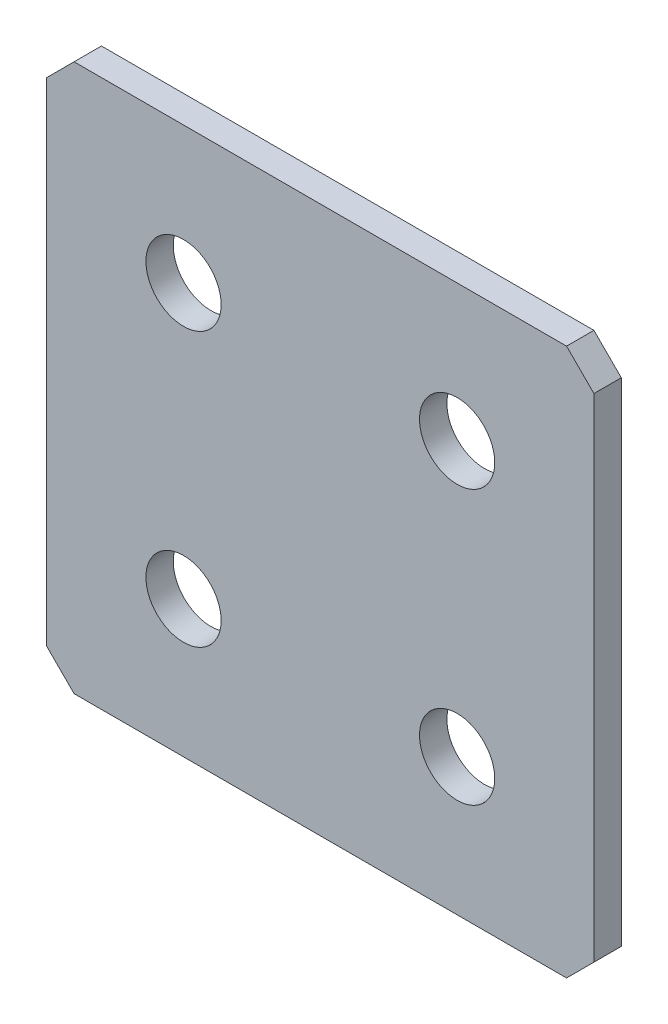
ISO-10303-21;
HEADER;
FILE_DESCRIPTION(('STEP AP214'),'2;1');
FILE_NAME('part.step','',(''),(''),'','','');
FILE_SCHEMA(('AUTOMOTIVE_DESIGN { 1 0 10303 214 1 1 1 1 }'));
ENDSEC;
DATA;
#1=APPLICATION_CONTEXT('core data for automotive mechanical design processes');
#2=APPLICATION_PROTOCOL_DEFINITION('international standard','automotive_design',2000,#1);
#3=PRODUCT_CONTEXT('',#1,'mechanical');
#4=PRODUCT('Part','Part','',(#3));
#5=PRODUCT_RELATED_PRODUCT_CATEGORY('part','',(#4));
#6=PRODUCT_DEFINITION_FORMATION('','',#4);
#7=PRODUCT_DEFINITION_CONTEXT('part definition',#1,'design');
#8=PRODUCT_DEFINITION('design','',#6,#7);
#9=PRODUCT_DEFINITION_SHAPE('','',#8);
#10=(LENGTH_UNIT() NAMED_UNIT(*) SI_UNIT(.MILLI.,.METRE.));
#11=(NAMED_UNIT(*) PLANE_ANGLE_UNIT() SI_UNIT($,.RADIAN.));
#12=(NAMED_UNIT(*) SI_UNIT($,.STERADIAN.) SOLID_ANGLE_UNIT());
#13=UNCERTAINTY_MEASURE_WITH_UNIT(LENGTH_MEASURE(1.E-05),#10,'distance_accuracy_value','');
#14=(GEOMETRIC_REPRESENTATION_CONTEXT(3) GLOBAL_UNCERTAINTY_ASSIGNED_CONTEXT((#13)) GLOBAL_UNIT_ASSIGNED_CONTEXT((#10,
#11,#12)) REPRESENTATION_CONTEXT('',''));
#15=CARTESIAN_POINT('',(0.,0.,0.));
#16=DIRECTION('',(0.,0.,1.));
#17=DIRECTION('',(1.,0.,0.));
#18=AXIS2_PLACEMENT_3D('',#15,#16,#17);
#19=CARTESIAN_POINT('',(20.,-20.,2.));
#20=DIRECTION('',(-1.,0.,0.));
#21=DIRECTION('',(0.,0.,1.));
#22=AXIS2_PLACEMENT_3D('',#19,#20,#21);
#23=PLANE('',#22);
#24=DIRECTION('',(0.,1.,0.));
#25=VECTOR('',#24,1.);
#26=CARTESIAN_POINT('',(20.,-20.,2.));
#27=LINE('',#26,#25);
#28=CARTESIAN_POINT('',(20.,-18.,2.));
#29=VERTEX_POINT('',#28);
#30=CARTESIAN_POINT('',(20.,18.,2.));
#31=VERTEX_POINT('',#30);
#32=EDGE_CURVE('E135',#29,#31,#27,.T.);
#33=ORIENTED_EDGE('',*,*,#32,.F.);
#34=DIRECTION('',(0.,0.,-1.));
#35=VECTOR('',#34,1.);
#36=CARTESIAN_POINT('',(20.,-18.,2.));
#37=LINE('',#36,#35);
#38=CARTESIAN_POINT('',(20.,-18.,0.));
#39=VERTEX_POINT('',#38);
#40=EDGE_CURVE('E174',#29,#39,#37,.T.);
#41=ORIENTED_EDGE('',*,*,#40,.T.);
#42=DIRECTION('',(0.,1.,0.));
#43=VECTOR('',#42,1.);
#44=CARTESIAN_POINT('',(20.,-20.,0.));
#45=LINE('',#44,#43);
#46=CARTESIAN_POINT('',(20.,18.,0.));
#47=VERTEX_POINT('',#46);
#48=EDGE_CURVE('E185',#39,#47,#45,.T.);
#49=ORIENTED_EDGE('',*,*,#48,.T.);
#50=DIRECTION('',(0.,0.,1.));
#51=VECTOR('',#50,1.);
#52=CARTESIAN_POINT('',(20.,18.,2.));
#53=LINE('',#52,#51);
#54=EDGE_CURVE('E171',#47,#31,#53,.T.);
#55=ORIENTED_EDGE('',*,*,#54,.T.);
#56=EDGE_LOOP('',(#33,#41,#49,#55));
#57=FACE_BOUND('',#56,.T.);
#58=ADVANCED_FACE('F40',(#57),#23,.F.);
#59=CARTESIAN_POINT('',(-20.,20.,2.));
#60=DIRECTION('',(0.,-1.,0.));
#61=DIRECTION('',(0.,0.,-1.));
#62=AXIS2_PLACEMENT_3D('',#59,#60,#61);
#63=PLANE('',#62);
#64=DIRECTION('',(-1.,0.,0.));
#65=VECTOR('',#64,1.);
#66=CARTESIAN_POINT('',(-20.,20.,0.));
#67=LINE('',#66,#65);
#68=CARTESIAN_POINT('',(18.,20.,0.));
#69=VERTEX_POINT('',#68);
#70=CARTESIAN_POINT('',(-18.,20.,0.));
#71=VERTEX_POINT('',#70);
#72=EDGE_CURVE('E143',#69,#71,#67,.T.);
#73=ORIENTED_EDGE('',*,*,#72,.T.);
#74=DIRECTION('',(0.,0.,1.));
#75=VECTOR('',#74,1.);
#76=CARTESIAN_POINT('',(-18.,20.,2.));
#77=LINE('',#76,#75);
#78=CARTESIAN_POINT('',(-18.,20.,2.));
#79=VERTEX_POINT('',#78);
#80=EDGE_CURVE('E11',#71,#79,#77,.T.);
#81=ORIENTED_EDGE('',*,*,#80,.T.);
#82=DIRECTION('',(-1.,0.,0.));
#83=VECTOR('',#82,1.);
#84=CARTESIAN_POINT('',(-20.,20.,2.));
#85=LINE('',#84,#83);
#86=CARTESIAN_POINT('',(18.,20.,2.));
#87=VERTEX_POINT('',#86);
#88=EDGE_CURVE('E140',#87,#79,#85,.T.);
#89=ORIENTED_EDGE('',*,*,#88,.F.);
#90=DIRECTION('',(0.,0.,-1.));
#91=VECTOR('',#90,1.);
#92=CARTESIAN_POINT('',(18.,20.,2.));
#93=LINE('',#92,#91);
#94=EDGE_CURVE('E49',#87,#69,#93,.T.);
#95=ORIENTED_EDGE('',*,*,#94,.T.);
#96=EDGE_LOOP('',(#73,#81,#89,#95));
#97=FACE_BOUND('',#96,.T.);
#98=ADVANCED_FACE('F181',(#97),#63,.F.);
#99=CARTESIAN_POINT('',(-20.,-20.,2.));
#100=DIRECTION('',(1.,0.,0.));
#101=DIRECTION('',(0.,0.,-1.));
#102=AXIS2_PLACEMENT_3D('',#99,#100,#101);
#103=PLANE('',#102);
#104=DIRECTION('',(0.,-1.,0.));
#105=VECTOR('',#104,1.);
#106=CARTESIAN_POINT('',(-20.,-20.,0.));
#107=LINE('',#106,#105);
#108=CARTESIAN_POINT('',(-20.,18.,0.));
#109=VERTEX_POINT('',#108);
#110=CARTESIAN_POINT('',(-20.,-18.,0.));
#111=VERTEX_POINT('',#110);
#112=EDGE_CURVE('E136',#109,#111,#107,.T.);
#113=ORIENTED_EDGE('',*,*,#112,.T.);
#114=DIRECTION('',(0.,0.,1.));
#115=VECTOR('',#114,1.);
#116=CARTESIAN_POINT('',(-20.,-18.,2.));
#117=LINE('',#116,#115);
#118=CARTESIAN_POINT('',(-20.,-18.,2.));
#119=VERTEX_POINT('',#118);
#120=EDGE_CURVE('E111',#111,#119,#117,.T.);
#121=ORIENTED_EDGE('',*,*,#120,.T.);
#122=DIRECTION('',(0.,-1.,0.));
#123=VECTOR('',#122,1.);
#124=CARTESIAN_POINT('',(-20.,-20.,2.));
#125=LINE('',#124,#123);
#126=CARTESIAN_POINT('',(-20.,18.,2.));
#127=VERTEX_POINT('',#126);
#128=EDGE_CURVE('E193',#127,#119,#125,.T.);
#129=ORIENTED_EDGE('',*,*,#128,.F.);
#130=DIRECTION('',(0.,0.,-1.));
#131=VECTOR('',#130,1.);
#132=CARTESIAN_POINT('',(-20.,18.,2.));
#133=LINE('',#132,#131);
#134=EDGE_CURVE('E117',#127,#109,#133,.T.);
#135=ORIENTED_EDGE('',*,*,#134,.T.);
#136=EDGE_LOOP('',(#113,#121,#129,#135));
#137=FACE_BOUND('',#136,.T.);
#138=ADVANCED_FACE('F245',(#137),#103,.F.);
#139=CARTESIAN_POINT('',(-20.,-20.,2.));
#140=DIRECTION('',(0.,1.,0.));
#141=DIRECTION('',(0.,0.,1.));
#142=AXIS2_PLACEMENT_3D('',#139,#140,#141);
#143=PLANE('',#142);
#144=DIRECTION('',(1.,0.,0.));
#145=VECTOR('',#144,1.);
#146=CARTESIAN_POINT('',(-20.,-20.,2.));
#147=LINE('',#146,#145);
#148=CARTESIAN_POINT('',(-18.,-20.,2.));
#149=VERTEX_POINT('',#148);
#150=CARTESIAN_POINT('',(18.,-20.,2.));
#151=VERTEX_POINT('',#150);
#152=EDGE_CURVE('E127',#149,#151,#147,.T.);
#153=ORIENTED_EDGE('',*,*,#152,.F.);
#154=DIRECTION('',(0.,0.,-1.));
#155=VECTOR('',#154,1.);
#156=CARTESIAN_POINT('',(-18.,-20.,2.));
#157=LINE('',#156,#155);
#158=CARTESIAN_POINT('',(-18.,-20.,0.));
#159=VERTEX_POINT('',#158);
#160=EDGE_CURVE('E110',#149,#159,#157,.T.);
#161=ORIENTED_EDGE('',*,*,#160,.T.);
#162=DIRECTION('',(1.,0.,0.));
#163=VECTOR('',#162,1.);
#164=CARTESIAN_POINT('',(-20.,-20.,0.));
#165=LINE('',#164,#163);
#166=CARTESIAN_POINT('',(18.,-20.,0.));
#167=VERTEX_POINT('',#166);
#168=EDGE_CURVE('E124',#159,#167,#165,.T.);
#169=ORIENTED_EDGE('',*,*,#168,.T.);
#170=DIRECTION('',(0.,0.,1.));
#171=VECTOR('',#170,1.);
#172=CARTESIAN_POINT('',(18.,-20.,2.));
#173=LINE('',#172,#171);
#174=EDGE_CURVE('E130',#167,#151,#173,.T.);
#175=ORIENTED_EDGE('',*,*,#174,.T.);
#176=EDGE_LOOP('',(#153,#161,#169,#175));
#177=FACE_BOUND('',#176,.T.);
#178=ADVANCED_FACE('F123',(#177),#143,.F.);
#179=CARTESIAN_POINT('',(0.,0.,2.));
#180=DIRECTION('',(0.,0.,-1.));
#181=DIRECTION('',(-1.,0.,0.));
#182=AXIS2_PLACEMENT_3D('',#179,#180,#181);
#183=PLANE('',#182);
#184=CARTESIAN_POINT('',(-10.,10.,2.));
#185=DIRECTION('',(0.,0.,1.));
#186=DIRECTION('',(1.,0.,0.));
#187=AXIS2_PLACEMENT_3D('',#184,#185,#186);
#188=CIRCLE('',#187,2.75);
#189=CARTESIAN_POINT('',(-7.25,10.,2.));
#190=VERTEX_POINT('',#189);
#191=EDGE_CURVE('E225',#190,#190,#188,.T.);
#192=ORIENTED_EDGE('',*,*,#191,.F.);
#193=EDGE_LOOP('',(#192));
#194=FACE_BOUND('',#193,.T.);
#195=CARTESIAN_POINT('',(10.,10.,2.));
#196=DIRECTION('',(0.,0.,1.));
#197=DIRECTION('',(1.,0.,0.));
#198=AXIS2_PLACEMENT_3D('',#195,#196,#197);
#199=CIRCLE('',#198,2.75);
#200=CARTESIAN_POINT('',(12.75,10.,2.));
#201=VERTEX_POINT('',#200);
#202=EDGE_CURVE('E217',#201,#201,#199,.T.);
#203=ORIENTED_EDGE('',*,*,#202,.F.);
#204=EDGE_LOOP('',(#203));
#205=FACE_BOUND('',#204,.T.);
#206=CARTESIAN_POINT('',(-10.,-10.,2.));
#207=DIRECTION('',(0.,0.,1.));
#208=DIRECTION('',(1.,0.,0.));
#209=AXIS2_PLACEMENT_3D('',#206,#207,#208);
#210=CIRCLE('',#209,2.75);
#211=CARTESIAN_POINT('',(-7.25,-10.,2.));
#212=VERTEX_POINT('',#211);
#213=EDGE_CURVE('E210',#212,#212,#210,.T.);
#214=ORIENTED_EDGE('',*,*,#213,.F.);
#215=EDGE_LOOP('',(#214));
#216=FACE_BOUND('',#215,.T.);
#217=CARTESIAN_POINT('',(9.99999999999999,-10.,2.));
#218=DIRECTION('',(0.,0.,1.));
#219=DIRECTION('',(1.,0.,0.));
#220=AXIS2_PLACEMENT_3D('',#217,#218,#219);
#221=CIRCLE('',#220,2.75);
#222=CARTESIAN_POINT('',(12.75,-10.,2.));
#223=VERTEX_POINT('',#222);
#224=EDGE_CURVE('E202',#223,#223,#221,.T.);
#225=ORIENTED_EDGE('',*,*,#224,.F.);
#226=EDGE_LOOP('',(#225));
#227=FACE_BOUND('',#226,.T.);
#228=ORIENTED_EDGE('',*,*,#128,.T.);
#229=DIRECTION('',(-0.707106781186546,0.707106781186549,0.));
#230=VECTOR('',#229,1.);
#231=CARTESIAN_POINT('',(-18.,-20.,2.));
#232=LINE('',#231,#230);
#233=EDGE_CURVE('E168',#119,#149,#232,.F.);
#234=ORIENTED_EDGE('',*,*,#233,.T.);
#235=ORIENTED_EDGE('',*,*,#152,.T.);
#236=DIRECTION('',(-0.707106781186549,-0.707106781186546,0.));
#237=VECTOR('',#236,1.);
#238=CARTESIAN_POINT('',(20.,-18.,2.));
#239=LINE('',#238,#237);
#240=EDGE_CURVE('E166',#151,#29,#239,.F.);
#241=ORIENTED_EDGE('',*,*,#240,.T.);
#242=ORIENTED_EDGE('',*,*,#32,.T.);
#243=DIRECTION('',(0.707106781186546,-0.707106781186549,0.));
#244=VECTOR('',#243,1.);
#245=CARTESIAN_POINT('',(18.,20.,2.));
#246=LINE('',#245,#244);
#247=EDGE_CURVE('E61',#31,#87,#246,.F.);
#248=ORIENTED_EDGE('',*,*,#247,.T.);
#249=ORIENTED_EDGE('',*,*,#88,.T.);
#250=DIRECTION('',(0.707106781186549,0.707106781186546,0.));
#251=VECTOR('',#250,1.);
#252=CARTESIAN_POINT('',(-20.,18.,2.));
#253=LINE('',#252,#251);
#254=EDGE_CURVE('E163',#79,#127,#253,.F.);
#255=ORIENTED_EDGE('',*,*,#254,.T.);
#256=EDGE_LOOP('',(#228,#234,#235,#241,#242,#248,#249,#255));
#257=FACE_BOUND('',#256,.T.);
#258=ADVANCED_FACE('F232',(#194,#205,#216,#227,#257),#183,.F.);
#259=CARTESIAN_POINT('',(0.,0.,0.));
#260=DIRECTION('',(0.,0.,-1.));
#261=DIRECTION('',(-1.,0.,0.));
#262=AXIS2_PLACEMENT_3D('',#259,#260,#261);
#263=PLANE('',#262);
#264=CARTESIAN_POINT('',(-10.,10.,0.));
#265=DIRECTION('',(0.,0.,1.));
#266=DIRECTION('',(1.,0.,0.));
#267=AXIS2_PLACEMENT_3D('',#264,#265,#266);
#268=CIRCLE('',#267,2.75);
#269=CARTESIAN_POINT('',(-7.25,10.,0.));
#270=VERTEX_POINT('',#269);
#271=EDGE_CURVE('E221',#270,#270,#268,.T.);
#272=ORIENTED_EDGE('',*,*,#271,.T.);
#273=EDGE_LOOP('',(#272));
#274=FACE_BOUND('',#273,.T.);
#275=CARTESIAN_POINT('',(10.,10.,0.));
#276=DIRECTION('',(0.,0.,1.));
#277=DIRECTION('',(1.,0.,0.));
#278=AXIS2_PLACEMENT_3D('',#275,#276,#277);
#279=CIRCLE('',#278,2.75);
#280=CARTESIAN_POINT('',(12.75,10.,0.));
#281=VERTEX_POINT('',#280);
#282=EDGE_CURVE('E213',#281,#281,#279,.T.);
#283=ORIENTED_EDGE('',*,*,#282,.T.);
#284=EDGE_LOOP('',(#283));
#285=FACE_BOUND('',#284,.T.);
#286=CARTESIAN_POINT('',(-10.,-10.,0.));
#287=DIRECTION('',(0.,0.,1.));
#288=DIRECTION('',(1.,0.,0.));
#289=AXIS2_PLACEMENT_3D('',#286,#287,#288);
#290=CIRCLE('',#289,2.75);
#291=CARTESIAN_POINT('',(-7.25,-10.,0.));
#292=VERTEX_POINT('',#291);
#293=EDGE_CURVE('E206',#292,#292,#290,.T.);
#294=ORIENTED_EDGE('',*,*,#293,.T.);
#295=EDGE_LOOP('',(#294));
#296=FACE_BOUND('',#295,.T.);
#297=CARTESIAN_POINT('',(9.99999999999999,-10.,0.));
#298=DIRECTION('',(0.,0.,1.));
#299=DIRECTION('',(1.,0.,0.));
#300=AXIS2_PLACEMENT_3D('',#297,#298,#299);
#301=CIRCLE('',#300,2.75);
#302=CARTESIAN_POINT('',(12.75,-10.,0.));
#303=VERTEX_POINT('',#302);
#304=EDGE_CURVE('E188',#303,#303,#301,.T.);
#305=ORIENTED_EDGE('',*,*,#304,.T.);
#306=EDGE_LOOP('',(#305));
#307=FACE_BOUND('',#306,.T.);
#308=ORIENTED_EDGE('',*,*,#168,.F.);
#309=DIRECTION('',(0.707106781186546,-0.707106781186549,0.));
#310=VECTOR('',#309,1.);
#311=CARTESIAN_POINT('',(-19.,-19.,0.));
#312=LINE('',#311,#310);
#313=EDGE_CURVE('E106',#159,#111,#312,.F.);
#314=ORIENTED_EDGE('',*,*,#313,.T.);
#315=ORIENTED_EDGE('',*,*,#112,.F.);
#316=DIRECTION('',(-0.707106781186549,-0.707106781186546,0.));
#317=VECTOR('',#316,1.);
#318=CARTESIAN_POINT('',(-19.,19.,0.));
#319=LINE('',#318,#317);
#320=EDGE_CURVE('E151',#109,#71,#319,.F.);
#321=ORIENTED_EDGE('',*,*,#320,.T.);
#322=ORIENTED_EDGE('',*,*,#72,.F.);
#323=DIRECTION('',(-0.707106781186546,0.707106781186549,0.));
#324=VECTOR('',#323,1.);
#325=CARTESIAN_POINT('',(19.,19.,0.));
#326=LINE('',#325,#324);
#327=EDGE_CURVE('E129',#69,#47,#326,.F.);
#328=ORIENTED_EDGE('',*,*,#327,.T.);
#329=ORIENTED_EDGE('',*,*,#48,.F.);
#330=DIRECTION('',(0.707106781186549,0.707106781186546,0.));
#331=VECTOR('',#330,1.);
#332=CARTESIAN_POINT('',(19.,-19.,0.));
#333=LINE('',#332,#331);
#334=EDGE_CURVE('E118',#39,#167,#333,.F.);
#335=ORIENTED_EDGE('',*,*,#334,.T.);
#336=EDGE_LOOP('',(#308,#314,#315,#321,#322,#328,#329,#335));
#337=FACE_BOUND('',#336,.T.);
#338=ADVANCED_FACE('F132',(#274,#285,#296,#307,#337),#263,.T.);
#339=CARTESIAN_POINT('',(-18.,-20.,2.));
#340=DIRECTION('',(0.707106781186549,0.707106781186546,0.));
#341=DIRECTION('',(0.,0.,-1.));
#342=AXIS2_PLACEMENT_3D('',#339,#340,#341);
#343=PLANE('',#342);
#344=ORIENTED_EDGE('',*,*,#233,.F.);
#345=ORIENTED_EDGE('',*,*,#120,.F.);
#346=ORIENTED_EDGE('',*,*,#313,.F.);
#347=ORIENTED_EDGE('',*,*,#160,.F.);
#348=EDGE_LOOP('',(#344,#345,#346,#347));
#349=FACE_BOUND('',#348,.T.);
#350=ADVANCED_FACE('F109',(#349),#343,.F.);
#351=CARTESIAN_POINT('',(20.,-18.,2.));
#352=DIRECTION('',(-0.707106781186546,0.707106781186549,0.));
#353=DIRECTION('',(0.,0.,-1.));
#354=AXIS2_PLACEMENT_3D('',#351,#352,#353);
#355=PLANE('',#354);
#356=ORIENTED_EDGE('',*,*,#240,.F.);
#357=ORIENTED_EDGE('',*,*,#174,.F.);
#358=ORIENTED_EDGE('',*,*,#334,.F.);
#359=ORIENTED_EDGE('',*,*,#40,.F.);
#360=EDGE_LOOP('',(#356,#357,#358,#359));
#361=FACE_BOUND('',#360,.T.);
#362=ADVANCED_FACE('F249',(#361),#355,.F.);
#363=CARTESIAN_POINT('',(-20.,18.,2.));
#364=DIRECTION('',(0.707106781186546,-0.707106781186549,0.));
#365=DIRECTION('',(0.,0.,-1.));
#366=AXIS2_PLACEMENT_3D('',#363,#364,#365);
#367=PLANE('',#366);
#368=ORIENTED_EDGE('',*,*,#254,.F.);
#369=ORIENTED_EDGE('',*,*,#80,.F.);
#370=ORIENTED_EDGE('',*,*,#320,.F.);
#371=ORIENTED_EDGE('',*,*,#134,.F.);
#372=EDGE_LOOP('',(#368,#369,#370,#371));
#373=FACE_BOUND('',#372,.T.);
#374=ADVANCED_FACE('F247',(#373),#367,.F.);
#375=CARTESIAN_POINT('',(18.,20.,2.));
#376=DIRECTION('',(-0.707106781186549,-0.707106781186546,0.));
#377=DIRECTION('',(0.,0.,-1.));
#378=AXIS2_PLACEMENT_3D('',#375,#376,#377);
#379=PLANE('',#378);
#380=ORIENTED_EDGE('',*,*,#247,.F.);
#381=ORIENTED_EDGE('',*,*,#54,.F.);
#382=ORIENTED_EDGE('',*,*,#327,.F.);
#383=ORIENTED_EDGE('',*,*,#94,.F.);
#384=EDGE_LOOP('',(#380,#381,#382,#383));
#385=FACE_BOUND('',#384,.T.);
#386=ADVANCED_FACE('F42',(#385),#379,.F.);
#387=CARTESIAN_POINT('',(9.99999999999999,-10.,2.));
#388=DIRECTION('',(0.,0.,1.));
#389=DIRECTION('',(1.,0.,0.));
#390=AXIS2_PLACEMENT_3D('',#387,#388,#389);
#391=CYLINDRICAL_SURFACE('',#390,2.75);
#392=ORIENTED_EDGE('',*,*,#304,.F.);
#393=EDGE_LOOP('',(#392));
#394=FACE_BOUND('',#393,.T.);
#395=ORIENTED_EDGE('',*,*,#224,.T.);
#396=EDGE_LOOP('',(#395));
#397=FACE_BOUND('',#396,.T.);
#398=ADVANCED_FACE('F254',(#394,#397),#391,.F.);
#399=CARTESIAN_POINT('',(-10.,-10.,2.));
#400=DIRECTION('',(0.,0.,1.));
#401=DIRECTION('',(1.,0.,0.));
#402=AXIS2_PLACEMENT_3D('',#399,#400,#401);
#403=CYLINDRICAL_SURFACE('',#402,2.75);
#404=ORIENTED_EDGE('',*,*,#293,.F.);
#405=EDGE_LOOP('',(#404));
#406=FACE_BOUND('',#405,.T.);
#407=ORIENTED_EDGE('',*,*,#213,.T.);
#408=EDGE_LOOP('',(#407));
#409=FACE_BOUND('',#408,.T.);
#410=ADVANCED_FACE('F316',(#406,#409),#403,.F.);
#411=CARTESIAN_POINT('',(10.,10.,2.));
#412=DIRECTION('',(0.,0.,1.));
#413=DIRECTION('',(1.,0.,0.));
#414=AXIS2_PLACEMENT_3D('',#411,#412,#413);
#415=CYLINDRICAL_SURFACE('',#414,2.75);
#416=ORIENTED_EDGE('',*,*,#282,.F.);
#417=EDGE_LOOP('',(#416));
#418=FACE_BOUND('',#417,.T.);
#419=ORIENTED_EDGE('',*,*,#202,.T.);
#420=EDGE_LOOP('',(#419));
#421=FACE_BOUND('',#420,.T.);
#422=ADVANCED_FACE('F324',(#418,#421),#415,.F.);
#423=CARTESIAN_POINT('',(-10.,10.,2.));
#424=DIRECTION('',(0.,0.,1.));
#425=DIRECTION('',(1.,0.,0.));
#426=AXIS2_PLACEMENT_3D('',#423,#424,#425);
#427=CYLINDRICAL_SURFACE('',#426,2.75);
#428=ORIENTED_EDGE('',*,*,#271,.F.);
#429=EDGE_LOOP('',(#428));
#430=FACE_BOUND('',#429,.T.);
#431=ORIENTED_EDGE('',*,*,#191,.T.);
#432=EDGE_LOOP('',(#431));
#433=FACE_BOUND('',#432,.T.);
#434=ADVANCED_FACE('F230',(#430,#433),#427,.F.);
#435=CLOSED_SHELL('',(#58,#98,#138,#178,#258,#338,#350,#362,#374,#386,#398,#410,#422,#434));
#436=MANIFOLD_SOLID_BREP('B2',#435);
#437=ADVANCED_BREP_SHAPE_REPRESENTATION('',(#18,#436),#14);
#438=SHAPE_DEFINITION_REPRESENTATION(#9,#437);
ENDSEC;
END-ISO-10303-21;
